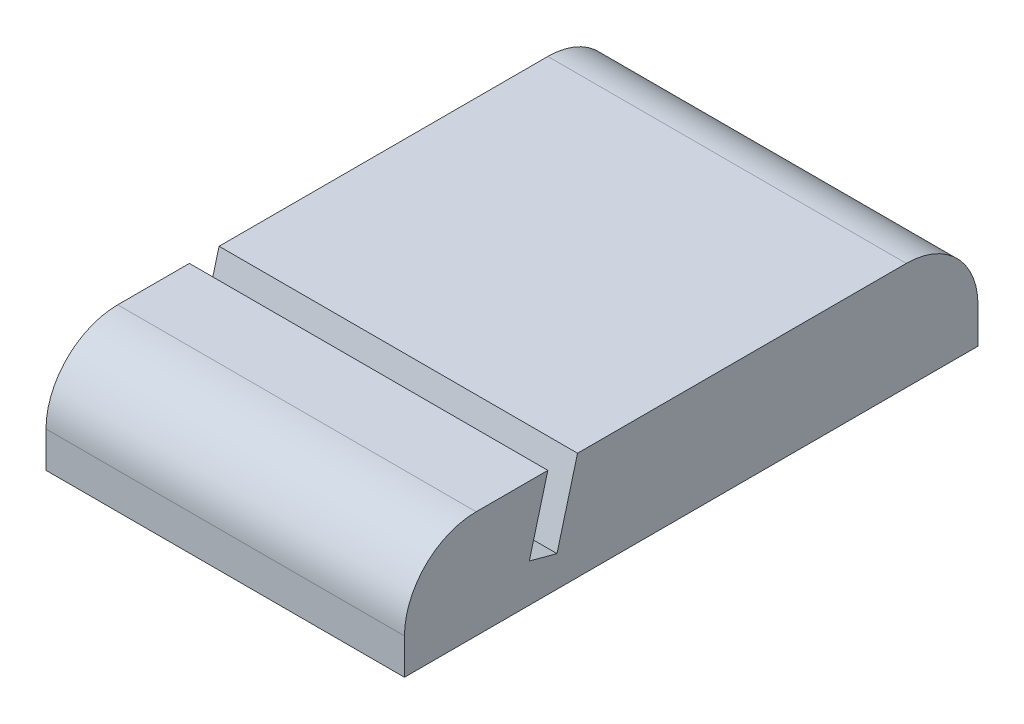
ISO-10303-21;
HEADER;
FILE_DESCRIPTION(('STEP AP214'),'2;1');
FILE_NAME('part.step','',(''),(''),'','','');
FILE_SCHEMA(('AUTOMOTIVE_DESIGN { 1 0 10303 214 1 1 1 1 }'));
ENDSEC;
DATA;
#1=APPLICATION_CONTEXT('core data for automotive mechanical design processes');
#2=APPLICATION_PROTOCOL_DEFINITION('international standard','automotive_design',2000,#1);
#3=PRODUCT_CONTEXT('',#1,'mechanical');
#4=PRODUCT('Part','Part','',(#3));
#5=PRODUCT_RELATED_PRODUCT_CATEGORY('part','',(#4));
#6=PRODUCT_DEFINITION_FORMATION('','',#4);
#7=PRODUCT_DEFINITION_CONTEXT('part definition',#1,'design');
#8=PRODUCT_DEFINITION('design','',#6,#7);
#9=PRODUCT_DEFINITION_SHAPE('','',#8);
#10=(LENGTH_UNIT() NAMED_UNIT(*) SI_UNIT(.MILLI.,.METRE.));
#11=(NAMED_UNIT(*) PLANE_ANGLE_UNIT() SI_UNIT($,.RADIAN.));
#12=(NAMED_UNIT(*) SI_UNIT($,.STERADIAN.) SOLID_ANGLE_UNIT());
#13=UNCERTAINTY_MEASURE_WITH_UNIT(LENGTH_MEASURE(1.E-05),#10,'distance_accuracy_value','');
#14=(GEOMETRIC_REPRESENTATION_CONTEXT(3) GLOBAL_UNCERTAINTY_ASSIGNED_CONTEXT((#13)) GLOBAL_UNIT_ASSIGNED_CONTEXT((#10,
#11,#12)) REPRESENTATION_CONTEXT('',''));
#15=CARTESIAN_POINT('',(0.,0.,0.));
#16=DIRECTION('',(0.,0.,1.));
#17=DIRECTION('',(1.,0.,0.));
#18=AXIS2_PLACEMENT_3D('',#15,#16,#17);
#19=CARTESIAN_POINT('',(50.,15.,40.));
#20=DIRECTION('',(0.,-1.,0.));
#21=DIRECTION('',(0.,0.,-1.));
#22=AXIS2_PLACEMENT_3D('',#19,#20,#21);
#23=PLANE('',#22);
#24=DIRECTION('',(0.,0.,1.));
#25=VECTOR('',#24,1.);
#26=CARTESIAN_POINT('',(0.,15.,40.));
#27=LINE('',#26,#25);
#28=CARTESIAN_POINT('',(0.,15.,20.));
#29=VERTEX_POINT('',#28);
#30=CARTESIAN_POINT('',(0.,15.,30.));
#31=VERTEX_POINT('',#30);
#32=EDGE_CURVE('E146',#29,#31,#27,.T.);
#33=ORIENTED_EDGE('',*,*,#32,.T.);
#34=DIRECTION('',(-1.,0.,0.));
#35=VECTOR('',#34,1.);
#36=CARTESIAN_POINT('',(50.,15.,30.));
#37=LINE('',#36,#35);
#38=CARTESIAN_POINT('',(50.,15.,30.));
#39=VERTEX_POINT('',#38);
#40=EDGE_CURVE('E11',#31,#39,#37,.F.);
#41=ORIENTED_EDGE('',*,*,#40,.T.);
#42=DIRECTION('',(0.,0.,1.));
#43=VECTOR('',#42,1.);
#44=CARTESIAN_POINT('',(50.,15.,40.));
#45=LINE('',#44,#43);
#46=CARTESIAN_POINT('',(50.,15.,20.));
#47=VERTEX_POINT('',#46);
#48=EDGE_CURVE('E117',#47,#39,#45,.T.);
#49=ORIENTED_EDGE('',*,*,#48,.F.);
#50=DIRECTION('',(-1.,0.,0.));
#51=VECTOR('',#50,1.);
#52=CARTESIAN_POINT('',(50.,15.,20.));
#53=LINE('',#52,#51);
#54=EDGE_CURVE('E145',#47,#29,#53,.T.);
#55=ORIENTED_EDGE('',*,*,#54,.T.);
#56=EDGE_LOOP('',(#33,#41,#49,#55));
#57=FACE_BOUND('',#56,.T.);
#58=ADVANCED_FACE('F33',(#57),#23,.F.);
#59=CARTESIAN_POINT('',(50.,0.,40.));
#60=DIRECTION('',(0.,0.,-1.));
#61=DIRECTION('',(-1.,0.,0.));
#62=AXIS2_PLACEMENT_3D('',#59,#60,#61);
#63=PLANE('',#62);
#64=DIRECTION('',(0.,-1.,0.));
#65=VECTOR('',#64,1.);
#66=CARTESIAN_POINT('',(50.,0.,40.));
#67=LINE('',#66,#65);
#68=CARTESIAN_POINT('',(50.,5.,40.));
#69=VERTEX_POINT('',#68);
#70=CARTESIAN_POINT('',(50.,0.,40.));
#71=VERTEX_POINT('',#70);
#72=EDGE_CURVE('E107',#69,#71,#67,.T.);
#73=ORIENTED_EDGE('',*,*,#72,.F.);
#74=DIRECTION('',(-1.,0.,0.));
#75=VECTOR('',#74,1.);
#76=CARTESIAN_POINT('',(50.,5.,40.));
#77=LINE('',#76,#75);
#78=CARTESIAN_POINT('',(0.,5.,40.));
#79=VERTEX_POINT('',#78);
#80=EDGE_CURVE('E41',#69,#79,#77,.T.);
#81=ORIENTED_EDGE('',*,*,#80,.T.);
#82=DIRECTION('',(0.,-1.,0.));
#83=VECTOR('',#82,1.);
#84=CARTESIAN_POINT('',(0.,0.,40.));
#85=LINE('',#84,#83);
#86=CARTESIAN_POINT('',(0.,0.,40.));
#87=VERTEX_POINT('',#86);
#88=EDGE_CURVE('E123',#79,#87,#85,.T.);
#89=ORIENTED_EDGE('',*,*,#88,.T.);
#90=DIRECTION('',(-1.,0.,0.));
#91=VECTOR('',#90,1.);
#92=CARTESIAN_POINT('',(50.,0.,40.));
#93=LINE('',#92,#91);
#94=EDGE_CURVE('E120',#71,#87,#93,.T.);
#95=ORIENTED_EDGE('',*,*,#94,.F.);
#96=EDGE_LOOP('',(#73,#81,#89,#95));
#97=FACE_BOUND('',#96,.T.);
#98=ADVANCED_FACE('F121',(#97),#63,.F.);
#99=CARTESIAN_POINT('',(50.,0.,40.));
#100=DIRECTION('',(0.,1.,0.));
#101=DIRECTION('',(0.,0.,1.));
#102=AXIS2_PLACEMENT_3D('',#99,#100,#101);
#103=PLANE('',#102);
#104=DIRECTION('',(0.,0.,-1.));
#105=VECTOR('',#104,1.);
#106=CARTESIAN_POINT('',(0.,0.,40.));
#107=LINE('',#106,#105);
#108=CARTESIAN_POINT('',(0.,0.,-40.));
#109=VERTEX_POINT('',#108);
#110=EDGE_CURVE('E149',#87,#109,#107,.T.);
#111=ORIENTED_EDGE('',*,*,#110,.T.);
#112=DIRECTION('',(-1.,0.,0.));
#113=VECTOR('',#112,1.);
#114=CARTESIAN_POINT('',(50.,0.,-40.));
#115=LINE('',#114,#113);
#116=CARTESIAN_POINT('',(50.,0.,-40.));
#117=VERTEX_POINT('',#116);
#118=EDGE_CURVE('E127',#117,#109,#115,.T.);
#119=ORIENTED_EDGE('',*,*,#118,.F.);
#120=DIRECTION('',(0.,0.,-1.));
#121=VECTOR('',#120,1.);
#122=CARTESIAN_POINT('',(50.,0.,40.));
#123=LINE('',#122,#121);
#124=EDGE_CURVE('E112',#71,#117,#123,.T.);
#125=ORIENTED_EDGE('',*,*,#124,.F.);
#126=ORIENTED_EDGE('',*,*,#94,.T.);
#127=EDGE_LOOP('',(#111,#119,#125,#126));
#128=FACE_BOUND('',#127,.T.);
#129=ADVANCED_FACE('F129',(#128),#103,.F.);
#130=CARTESIAN_POINT('',(50.,15.,-40.));
#131=DIRECTION('',(0.,0.,1.));
#132=DIRECTION('',(1.,0.,0.));
#133=AXIS2_PLACEMENT_3D('',#130,#131,#132);
#134=PLANE('',#133);
#135=DIRECTION('',(0.,1.,0.));
#136=VECTOR('',#135,1.);
#137=CARTESIAN_POINT('',(0.,15.,-40.));
#138=LINE('',#137,#136);
#139=CARTESIAN_POINT('',(0.,5.00000000000001,-40.));
#140=VERTEX_POINT('',#139);
#141=EDGE_CURVE('E151',#109,#140,#138,.T.);
#142=ORIENTED_EDGE('',*,*,#141,.T.);
#143=DIRECTION('',(-1.,0.,0.));
#144=VECTOR('',#143,1.);
#145=CARTESIAN_POINT('',(50.,5.00000000000001,-40.));
#146=LINE('',#145,#144);
#147=CARTESIAN_POINT('',(50.,5.00000000000001,-40.));
#148=VERTEX_POINT('',#147);
#149=EDGE_CURVE('E180',#140,#148,#146,.F.);
#150=ORIENTED_EDGE('',*,*,#149,.T.);
#151=DIRECTION('',(0.,1.,0.));
#152=VECTOR('',#151,1.);
#153=CARTESIAN_POINT('',(50.,15.,-40.));
#154=LINE('',#153,#152);
#155=EDGE_CURVE('E132',#117,#148,#154,.T.);
#156=ORIENTED_EDGE('',*,*,#155,.F.);
#157=ORIENTED_EDGE('',*,*,#118,.T.);
#158=EDGE_LOOP('',(#142,#150,#156,#157));
#159=FACE_BOUND('',#158,.T.);
#160=ADVANCED_FACE('F191',(#159),#134,.F.);
#161=CARTESIAN_POINT('',(50.,15.,15.8588952783597));
#162=DIRECTION('',(0.,-1.,0.));
#163=DIRECTION('',(0.,0.,-1.));
#164=AXIS2_PLACEMENT_3D('',#161,#162,#163);
#165=PLANE('',#164);
#166=DIRECTION('',(0.,0.,1.));
#167=VECTOR('',#166,1.);
#168=CARTESIAN_POINT('',(50.,15.,15.8588952783597));
#169=LINE('',#168,#167);
#170=CARTESIAN_POINT('',(50.,15.,-30.));
#171=VERTEX_POINT('',#170);
#172=CARTESIAN_POINT('',(50.,15.,15.8588952783597));
#173=VERTEX_POINT('',#172);
#174=EDGE_CURVE('E134',#171,#173,#169,.T.);
#175=ORIENTED_EDGE('',*,*,#174,.F.);
#176=DIRECTION('',(-1.,0.,0.));
#177=VECTOR('',#176,1.);
#178=CARTESIAN_POINT('',(50.,15.,-30.));
#179=LINE('',#178,#177);
#180=CARTESIAN_POINT('',(0.,15.,-30.));
#181=VERTEX_POINT('',#180);
#182=EDGE_CURVE('E126',#171,#181,#179,.T.);
#183=ORIENTED_EDGE('',*,*,#182,.T.);
#184=DIRECTION('',(0.,0.,1.));
#185=VECTOR('',#184,1.);
#186=CARTESIAN_POINT('',(0.,15.,15.8588952783597));
#187=LINE('',#186,#185);
#188=CARTESIAN_POINT('',(0.,15.,15.8588952783597));
#189=VERTEX_POINT('',#188);
#190=EDGE_CURVE('E154',#181,#189,#187,.T.);
#191=ORIENTED_EDGE('',*,*,#190,.T.);
#192=DIRECTION('',(-1.,0.,0.));
#193=VECTOR('',#192,1.);
#194=CARTESIAN_POINT('',(50.,15.,15.8588952783597));
#195=LINE('',#194,#193);
#196=EDGE_CURVE('E170',#173,#189,#195,.T.);
#197=ORIENTED_EDGE('',*,*,#196,.F.);
#198=EDGE_LOOP('',(#175,#183,#191,#197));
#199=FACE_BOUND('',#198,.T.);
#200=ADVANCED_FACE('F199',(#199),#165,.F.);
#201=CARTESIAN_POINT('',(50.,4.30546555669923,18.724487145869));
#202=DIRECTION('',(0.,-0.258819045102523,-0.965925826289068));
#203=DIRECTION('',(0.,0.965925826289068,-0.258819045102523));
#204=AXIS2_PLACEMENT_3D('',#201,#202,#203);
#205=PLANE('',#204);
#206=DIRECTION('',(0.,-0.965925826289068,0.258819045102523));
#207=VECTOR('',#206,1.);
#208=CARTESIAN_POINT('',(0.,4.30546555669923,18.724487145869));
#209=LINE('',#208,#207);
#210=CARTESIAN_POINT('',(0.,4.30546555669923,18.724487145869));
#211=VERTEX_POINT('',#210);
#212=EDGE_CURVE('E156',#189,#211,#209,.T.);
#213=ORIENTED_EDGE('',*,*,#212,.T.);
#214=DIRECTION('',(-1.,0.,0.));
#215=VECTOR('',#214,1.);
#216=CARTESIAN_POINT('',(50.,4.30546555669923,18.724487145869));
#217=LINE('',#216,#215);
#218=CARTESIAN_POINT('',(50.,4.30546555669923,18.724487145869));
#219=VERTEX_POINT('',#218);
#220=EDGE_CURVE('E167',#219,#211,#217,.T.);
#221=ORIENTED_EDGE('',*,*,#220,.F.);
#222=DIRECTION('',(0.,-0.965925826289068,0.258819045102523));
#223=VECTOR('',#222,1.);
#224=CARTESIAN_POINT('',(50.,4.30546555669923,18.724487145869));
#225=LINE('',#224,#223);
#226=EDGE_CURVE('E139',#173,#219,#225,.T.);
#227=ORIENTED_EDGE('',*,*,#226,.F.);
#228=ORIENTED_EDGE('',*,*,#196,.T.);
#229=EDGE_LOOP('',(#213,#221,#227,#228));
#230=FACE_BOUND('',#229,.T.);
#231=ADVANCED_FACE('F206',(#230),#205,.F.);
#232=CARTESIAN_POINT('',(50.,5.34074173710933,22.5881904510252));
#233=DIRECTION('',(0.,-0.965925826289067,0.258819045102524));
#234=DIRECTION('',(0.,-0.258819045102525,-0.965925826289067));
#235=AXIS2_PLACEMENT_3D('',#232,#233,#234);
#236=PLANE('',#235);
#237=DIRECTION('',(0.,0.258819045102524,0.965925826289067));
#238=VECTOR('',#237,1.);
#239=CARTESIAN_POINT('',(0.,5.34074173710933,22.5881904510252));
#240=LINE('',#239,#238);
#241=CARTESIAN_POINT('',(0.,5.34074173710933,22.5881904510252));
#242=VERTEX_POINT('',#241);
#243=EDGE_CURVE('E158',#211,#242,#240,.T.);
#244=ORIENTED_EDGE('',*,*,#243,.T.);
#245=DIRECTION('',(-1.,0.,0.));
#246=VECTOR('',#245,1.);
#247=CARTESIAN_POINT('',(50.,5.34074173710933,22.5881904510252));
#248=LINE('',#247,#246);
#249=CARTESIAN_POINT('',(50.,5.34074173710933,22.5881904510252));
#250=VERTEX_POINT('',#249);
#251=EDGE_CURVE('E164',#250,#242,#248,.T.);
#252=ORIENTED_EDGE('',*,*,#251,.F.);
#253=DIRECTION('',(0.,0.258819045102524,0.965925826289067));
#254=VECTOR('',#253,1.);
#255=CARTESIAN_POINT('',(50.,5.34074173710933,22.5881904510252));
#256=LINE('',#255,#254);
#257=EDGE_CURVE('E141',#219,#250,#256,.T.);
#258=ORIENTED_EDGE('',*,*,#257,.F.);
#259=ORIENTED_EDGE('',*,*,#220,.T.);
#260=EDGE_LOOP('',(#244,#252,#258,#259));
#261=FACE_BOUND('',#260,.T.);
#262=ADVANCED_FACE('F210',(#261),#236,.F.);
#263=CARTESIAN_POINT('',(50.,15.,20.));
#264=DIRECTION('',(0.,0.258819045102524,0.965925826289067));
#265=DIRECTION('',(0.,-0.965925826289067,0.258819045102524));
#266=AXIS2_PLACEMENT_3D('',#263,#264,#265);
#267=PLANE('',#266);
#268=DIRECTION('',(0.,0.965925826289067,-0.258819045102524));
#269=VECTOR('',#268,1.);
#270=CARTESIAN_POINT('',(0.,15.,20.));
#271=LINE('',#270,#269);
#272=EDGE_CURVE('E160',#242,#29,#271,.T.);
#273=ORIENTED_EDGE('',*,*,#272,.T.);
#274=ORIENTED_EDGE('',*,*,#54,.F.);
#275=DIRECTION('',(0.,0.965925826289067,-0.258819045102524));
#276=VECTOR('',#275,1.);
#277=CARTESIAN_POINT('',(50.,15.,20.));
#278=LINE('',#277,#276);
#279=EDGE_CURVE('E143',#250,#47,#278,.T.);
#280=ORIENTED_EDGE('',*,*,#279,.F.);
#281=ORIENTED_EDGE('',*,*,#251,.T.);
#282=EDGE_LOOP('',(#273,#274,#280,#281));
#283=FACE_BOUND('',#282,.T.);
#284=ADVANCED_FACE('F215',(#283),#267,.F.);
#285=CARTESIAN_POINT('',(50.,0.,0.));
#286=DIRECTION('',(-1.,0.,0.));
#287=DIRECTION('',(0.,0.,1.));
#288=AXIS2_PLACEMENT_3D('',#285,#286,#287);
#289=PLANE('',#288);
#290=ORIENTED_EDGE('',*,*,#155,.T.);
#291=CARTESIAN_POINT('',(50.,5.00000000000001,-30.));
#292=DIRECTION('',(-1.,0.,0.));
#293=DIRECTION('',(0.,0.,1.));
#294=AXIS2_PLACEMENT_3D('',#291,#292,#293);
#295=CIRCLE('',#294,10.);
#296=EDGE_CURVE('E183',#148,#171,#295,.F.);
#297=ORIENTED_EDGE('',*,*,#296,.T.);
#298=ORIENTED_EDGE('',*,*,#174,.T.);
#299=ORIENTED_EDGE('',*,*,#226,.T.);
#300=ORIENTED_EDGE('',*,*,#257,.T.);
#301=ORIENTED_EDGE('',*,*,#279,.T.);
#302=ORIENTED_EDGE('',*,*,#48,.T.);
#303=CARTESIAN_POINT('',(50.,5.,30.));
#304=DIRECTION('',(-1.,0.,0.));
#305=DIRECTION('',(0.,0.,1.));
#306=AXIS2_PLACEMENT_3D('',#303,#304,#305);
#307=CIRCLE('',#306,10.);
#308=EDGE_CURVE('E48',#39,#69,#307,.F.);
#309=ORIENTED_EDGE('',*,*,#308,.T.);
#310=ORIENTED_EDGE('',*,*,#72,.T.);
#311=ORIENTED_EDGE('',*,*,#124,.T.);
#312=EDGE_LOOP('',(#290,#297,#298,#299,#300,#301,#302,#309,#310,#311));
#313=FACE_BOUND('',#312,.T.);
#314=ADVANCED_FACE('F110',(#313),#289,.F.);
#315=CARTESIAN_POINT('',(0.,0.,0.));
#316=DIRECTION('',(-1.,0.,0.));
#317=DIRECTION('',(0.,0.,1.));
#318=AXIS2_PLACEMENT_3D('',#315,#316,#317);
#319=PLANE('',#318);
#320=ORIENTED_EDGE('',*,*,#190,.F.);
#321=CARTESIAN_POINT('',(0.,5.00000000000001,-30.));
#322=DIRECTION('',(-1.,0.,0.));
#323=DIRECTION('',(0.,0.,1.));
#324=AXIS2_PLACEMENT_3D('',#321,#322,#323);
#325=CIRCLE('',#324,10.);
#326=EDGE_CURVE('E178',#181,#140,#325,.T.);
#327=ORIENTED_EDGE('',*,*,#326,.T.);
#328=ORIENTED_EDGE('',*,*,#141,.F.);
#329=ORIENTED_EDGE('',*,*,#110,.F.);
#330=ORIENTED_EDGE('',*,*,#88,.F.);
#331=CARTESIAN_POINT('',(0.,5.,30.));
#332=DIRECTION('',(-1.,0.,0.));
#333=DIRECTION('',(0.,0.,1.));
#334=AXIS2_PLACEMENT_3D('',#331,#332,#333);
#335=CIRCLE('',#334,10.);
#336=EDGE_CURVE('E176',#79,#31,#335,.T.);
#337=ORIENTED_EDGE('',*,*,#336,.T.);
#338=ORIENTED_EDGE('',*,*,#32,.F.);
#339=ORIENTED_EDGE('',*,*,#272,.F.);
#340=ORIENTED_EDGE('',*,*,#243,.F.);
#341=ORIENTED_EDGE('',*,*,#212,.F.);
#342=EDGE_LOOP('',(#320,#327,#328,#329,#330,#337,#338,#339,#340,#341));
#343=FACE_BOUND('',#342,.T.);
#344=ADVANCED_FACE('F187',(#343),#319,.T.);
#345=CARTESIAN_POINT('',(50.,5.00000000000001,-30.));
#346=DIRECTION('',(-1.,0.,0.));
#347=DIRECTION('',(0.,0.,1.));
#348=AXIS2_PLACEMENT_3D('',#345,#346,#347);
#349=CYLINDRICAL_SURFACE('',#348,10.);
#350=ORIENTED_EDGE('',*,*,#296,.F.);
#351=ORIENTED_EDGE('',*,*,#149,.F.);
#352=ORIENTED_EDGE('',*,*,#326,.F.);
#353=ORIENTED_EDGE('',*,*,#182,.F.);
#354=EDGE_LOOP('',(#350,#351,#352,#353));
#355=FACE_BOUND('',#354,.T.);
#356=ADVANCED_FACE('F197',(#355),#349,.T.);
#357=CARTESIAN_POINT('',(50.,5.,30.));
#358=DIRECTION('',(-1.,0.,0.));
#359=DIRECTION('',(0.,0.,1.));
#360=AXIS2_PLACEMENT_3D('',#357,#358,#359);
#361=CYLINDRICAL_SURFACE('',#360,10.);
#362=ORIENTED_EDGE('',*,*,#308,.F.);
#363=ORIENTED_EDGE('',*,*,#40,.F.);
#364=ORIENTED_EDGE('',*,*,#336,.F.);
#365=ORIENTED_EDGE('',*,*,#80,.F.);
#366=EDGE_LOOP('',(#362,#363,#364,#365));
#367=FACE_BOUND('',#366,.T.);
#368=ADVANCED_FACE('F35',(#367),#361,.T.);
#369=CLOSED_SHELL('',(#58,#98,#129,#160,#200,#231,#262,#284,#314,#344,#356,#368));
#370=MANIFOLD_SOLID_BREP('B2',#369);
#371=ADVANCED_BREP_SHAPE_REPRESENTATION('',(#18,#370),#14);
#372=SHAPE_DEFINITION_REPRESENTATION(#9,#371);
ENDSEC;
END-ISO-10303-21;
